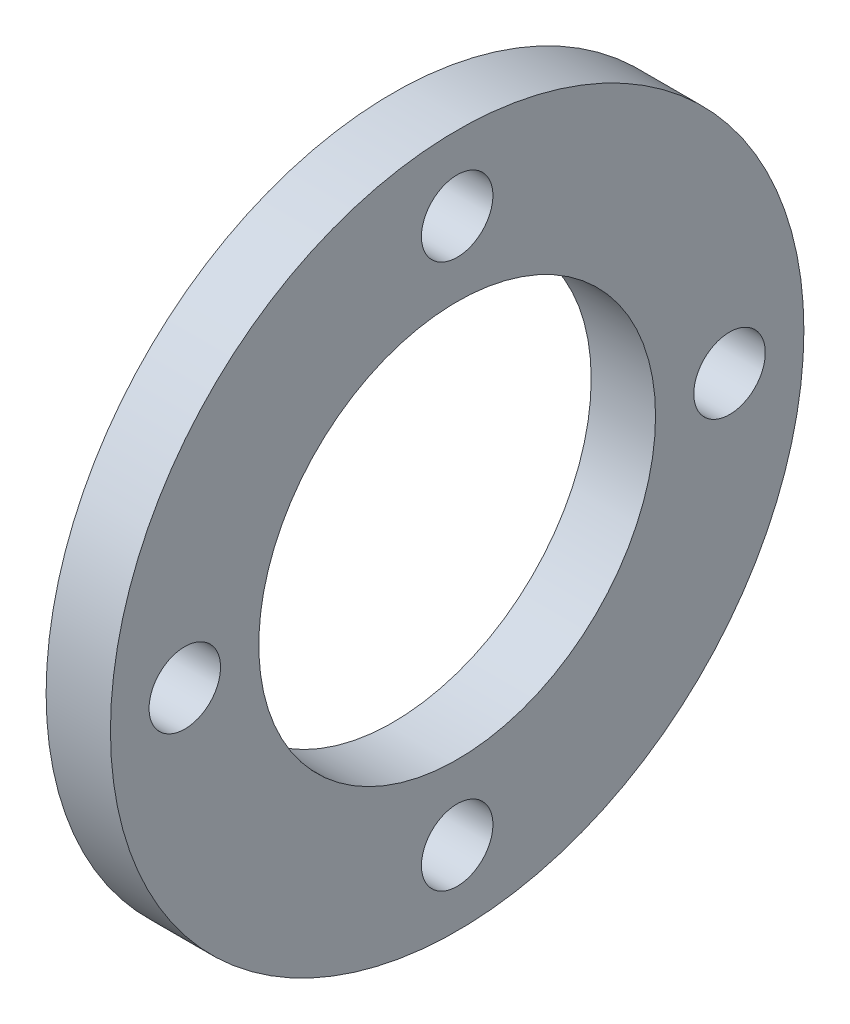
ISO-10303-21;
HEADER;
FILE_DESCRIPTION(('STEP AP214'),'2;1');
FILE_NAME('part.step','',(''),(''),'','','');
FILE_SCHEMA(('AUTOMOTIVE_DESIGN { 1 0 10303 214 1 1 1 1 }'));
ENDSEC;
DATA;
#1=APPLICATION_CONTEXT('core data for automotive mechanical design processes');
#2=APPLICATION_PROTOCOL_DEFINITION('international standard','automotive_design',2000,#1);
#3=PRODUCT_CONTEXT('',#1,'mechanical');
#4=PRODUCT('Part','Part','',(#3));
#5=PRODUCT_RELATED_PRODUCT_CATEGORY('part','',(#4));
#6=PRODUCT_DEFINITION_FORMATION('','',#4);
#7=PRODUCT_DEFINITION_CONTEXT('part definition',#1,'design');
#8=PRODUCT_DEFINITION('design','',#6,#7);
#9=PRODUCT_DEFINITION_SHAPE('','',#8);
#10=(LENGTH_UNIT() NAMED_UNIT(*) SI_UNIT(.MILLI.,.METRE.));
#11=(NAMED_UNIT(*) PLANE_ANGLE_UNIT() SI_UNIT($,.RADIAN.));
#12=(NAMED_UNIT(*) SI_UNIT($,.STERADIAN.) SOLID_ANGLE_UNIT());
#13=UNCERTAINTY_MEASURE_WITH_UNIT(LENGTH_MEASURE(1.E-05),#10,'distance_accuracy_value','');
#14=(GEOMETRIC_REPRESENTATION_CONTEXT(3) GLOBAL_UNCERTAINTY_ASSIGNED_CONTEXT((#13)) GLOBAL_UNIT_ASSIGNED_CONTEXT((#10,
#11,#12)) REPRESENTATION_CONTEXT('',''));
#15=CARTESIAN_POINT('',(0.,0.,0.));
#16=DIRECTION('',(0.,0.,1.));
#17=DIRECTION('',(1.,0.,0.));
#18=AXIS2_PLACEMENT_3D('',#15,#16,#17);
#19=CARTESIAN_POINT('',(18.,0.,76.2));
#20=DIRECTION('',(-1.,0.,0.));
#21=DIRECTION('',(0.,0.,1.));
#22=AXIS2_PLACEMENT_3D('',#19,#20,#21);
#23=CYLINDRICAL_SURFACE('',#22,10.);
#24=CARTESIAN_POINT('',(18.,0.,76.2));
#25=DIRECTION('',(-1.,0.,0.));
#26=DIRECTION('',(0.,0.,1.));
#27=AXIS2_PLACEMENT_3D('',#24,#25,#26);
#28=CIRCLE('',#27,10.);
#29=CARTESIAN_POINT('',(18.,0.,86.2));
#30=VERTEX_POINT('',#29);
#31=EDGE_CURVE('E39',#30,#30,#28,.T.);
#32=ORIENTED_EDGE('',*,*,#31,.F.);
#33=EDGE_LOOP('',(#32));
#34=FACE_BOUND('',#33,.T.);
#35=CARTESIAN_POINT('',(0.,0.,76.2));
#36=DIRECTION('',(-1.,0.,0.));
#37=DIRECTION('',(0.,0.,1.));
#38=AXIS2_PLACEMENT_3D('',#35,#36,#37);
#39=CIRCLE('',#38,10.);
#40=CARTESIAN_POINT('',(0.,0.,86.2));
#41=VERTEX_POINT('',#40);
#42=EDGE_CURVE('E16',#41,#41,#39,.F.);
#43=ORIENTED_EDGE('',*,*,#42,.F.);
#44=EDGE_LOOP('',(#43));
#45=FACE_BOUND('',#44,.T.);
#46=ADVANCED_FACE('F13',(#34,#45),#23,.F.);
#47=CARTESIAN_POINT('',(18.,-76.2,0.));
#48=DIRECTION('',(-1.,0.,0.));
#49=DIRECTION('',(0.,0.,1.));
#50=AXIS2_PLACEMENT_3D('',#47,#48,#49);
#51=CYLINDRICAL_SURFACE('',#50,9.99999999999999);
#52=CARTESIAN_POINT('',(18.,-76.2,0.));
#53=DIRECTION('',(-1.,0.,0.));
#54=DIRECTION('',(0.,0.,1.));
#55=AXIS2_PLACEMENT_3D('',#52,#53,#54);
#56=CIRCLE('',#55,9.99999999999999);
#57=CARTESIAN_POINT('',(18.,-76.2,10.));
#58=VERTEX_POINT('',#57);
#59=EDGE_CURVE('E36',#58,#58,#56,.T.);
#60=ORIENTED_EDGE('',*,*,#59,.F.);
#61=EDGE_LOOP('',(#60));
#62=FACE_BOUND('',#61,.T.);
#63=CARTESIAN_POINT('',(0.,-76.2,0.));
#64=DIRECTION('',(-1.,0.,0.));
#65=DIRECTION('',(0.,0.,1.));
#66=AXIS2_PLACEMENT_3D('',#63,#64,#65);
#67=CIRCLE('',#66,9.99999999999999);
#68=CARTESIAN_POINT('',(0.,-76.2,10.));
#69=VERTEX_POINT('',#68);
#70=EDGE_CURVE('E50',#69,#69,#67,.F.);
#71=ORIENTED_EDGE('',*,*,#70,.F.);
#72=EDGE_LOOP('',(#71));
#73=FACE_BOUND('',#72,.T.);
#74=ADVANCED_FACE('F61',(#62,#73),#51,.F.);
#75=CARTESIAN_POINT('',(18.,0.,-76.2));
#76=DIRECTION('',(-1.,0.,0.));
#77=DIRECTION('',(0.,0.,1.));
#78=AXIS2_PLACEMENT_3D('',#75,#76,#77);
#79=CYLINDRICAL_SURFACE('',#78,10.);
#80=CARTESIAN_POINT('',(18.,0.,-76.2));
#81=DIRECTION('',(-1.,0.,0.));
#82=DIRECTION('',(0.,0.,1.));
#83=AXIS2_PLACEMENT_3D('',#80,#81,#82);
#84=CIRCLE('',#83,10.);
#85=CARTESIAN_POINT('',(18.,0.,-66.2));
#86=VERTEX_POINT('',#85);
#87=EDGE_CURVE('E33',#86,#86,#84,.T.);
#88=ORIENTED_EDGE('',*,*,#87,.F.);
#89=EDGE_LOOP('',(#88));
#90=FACE_BOUND('',#89,.T.);
#91=CARTESIAN_POINT('',(0.,0.,-76.2));
#92=DIRECTION('',(-1.,0.,0.));
#93=DIRECTION('',(0.,0.,1.));
#94=AXIS2_PLACEMENT_3D('',#91,#92,#93);
#95=CIRCLE('',#94,10.);
#96=CARTESIAN_POINT('',(0.,0.,-66.2));
#97=VERTEX_POINT('',#96);
#98=EDGE_CURVE('E48',#97,#97,#95,.F.);
#99=ORIENTED_EDGE('',*,*,#98,.F.);
#100=EDGE_LOOP('',(#99));
#101=FACE_BOUND('',#100,.T.);
#102=ADVANCED_FACE('F67',(#90,#101),#79,.F.);
#103=CARTESIAN_POINT('',(18.,76.2,0.));
#104=DIRECTION('',(-1.,0.,0.));
#105=DIRECTION('',(0.,0.,1.));
#106=AXIS2_PLACEMENT_3D('',#103,#104,#105);
#107=CYLINDRICAL_SURFACE('',#106,9.99999999999999);
#108=CARTESIAN_POINT('',(18.,76.2,0.));
#109=DIRECTION('',(-1.,0.,0.));
#110=DIRECTION('',(0.,0.,1.));
#111=AXIS2_PLACEMENT_3D('',#108,#109,#110);
#112=CIRCLE('',#111,9.99999999999999);
#113=CARTESIAN_POINT('',(18.,76.2,9.99999999999999));
#114=VERTEX_POINT('',#113);
#115=EDGE_CURVE('E30',#114,#114,#112,.T.);
#116=ORIENTED_EDGE('',*,*,#115,.F.);
#117=EDGE_LOOP('',(#116));
#118=FACE_BOUND('',#117,.T.);
#119=CARTESIAN_POINT('',(0.,76.2,0.));
#120=DIRECTION('',(-1.,0.,0.));
#121=DIRECTION('',(0.,0.,1.));
#122=AXIS2_PLACEMENT_3D('',#119,#120,#121);
#123=CIRCLE('',#122,9.99999999999999);
#124=CARTESIAN_POINT('',(0.,76.2,9.99999999999999));
#125=VERTEX_POINT('',#124);
#126=EDGE_CURVE('E45',#125,#125,#123,.F.);
#127=ORIENTED_EDGE('',*,*,#126,.F.);
#128=EDGE_LOOP('',(#127));
#129=FACE_BOUND('',#128,.T.);
#130=ADVANCED_FACE('F87',(#118,#129),#107,.F.);
#131=CARTESIAN_POINT('',(0.,0.,0.));
#132=DIRECTION('',(1.,0.,0.));
#133=DIRECTION('',(0.,0.,-1.));
#134=AXIS2_PLACEMENT_3D('',#131,#132,#133);
#135=CYLINDRICAL_SURFACE('',#134,55.5);
#136=CARTESIAN_POINT('',(0.,0.,0.));
#137=DIRECTION('',(1.,0.,0.));
#138=DIRECTION('',(0.,0.,-1.));
#139=AXIS2_PLACEMENT_3D('',#136,#137,#138);
#140=CIRCLE('',#139,55.5);
#141=CARTESIAN_POINT('',(0.,0.,-55.5));
#142=VERTEX_POINT('',#141);
#143=EDGE_CURVE('E42',#142,#142,#140,.T.);
#144=ORIENTED_EDGE('',*,*,#143,.F.);
#145=EDGE_LOOP('',(#144));
#146=FACE_BOUND('',#145,.T.);
#147=CARTESIAN_POINT('',(18.,0.,0.));
#148=DIRECTION('',(1.,0.,0.));
#149=DIRECTION('',(0.,0.,-1.));
#150=AXIS2_PLACEMENT_3D('',#147,#148,#149);
#151=CIRCLE('',#150,55.5);
#152=CARTESIAN_POINT('',(18.,0.,-55.5));
#153=VERTEX_POINT('',#152);
#154=EDGE_CURVE('E25',#153,#153,#151,.F.);
#155=ORIENTED_EDGE('',*,*,#154,.F.);
#156=EDGE_LOOP('',(#155));
#157=FACE_BOUND('',#156,.T.);
#158=ADVANCED_FACE('F83',(#146,#157),#135,.F.);
#159=CARTESIAN_POINT('',(0.,-98.1640031628222,-97.));
#160=DIRECTION('',(-1.,0.,0.));
#161=DIRECTION('',(0.,0.,1.));
#162=AXIS2_PLACEMENT_3D('',#159,#160,#161);
#163=PLANE('',#162);
#164=ORIENTED_EDGE('',*,*,#143,.T.);
#165=EDGE_LOOP('',(#164));
#166=FACE_BOUND('',#165,.T.);
#167=ORIENTED_EDGE('',*,*,#126,.T.);
#168=EDGE_LOOP('',(#167));
#169=FACE_BOUND('',#168,.T.);
#170=ORIENTED_EDGE('',*,*,#98,.T.);
#171=EDGE_LOOP('',(#170));
#172=FACE_BOUND('',#171,.T.);
#173=ORIENTED_EDGE('',*,*,#70,.T.);
#174=EDGE_LOOP('',(#173));
#175=FACE_BOUND('',#174,.T.);
#176=ORIENTED_EDGE('',*,*,#42,.T.);
#177=EDGE_LOOP('',(#176));
#178=FACE_BOUND('',#177,.T.);
#179=CARTESIAN_POINT('',(0.,0.,0.));
#180=DIRECTION('',(1.,0.,0.));
#181=DIRECTION('',(0.,0.,-1.));
#182=AXIS2_PLACEMENT_3D('',#179,#180,#181);
#183=CIRCLE('',#182,97.);
#184=CARTESIAN_POINT('',(0.,0.,-97.));
#185=VERTEX_POINT('',#184);
#186=EDGE_CURVE('E20',#185,#185,#183,.T.);
#187=ORIENTED_EDGE('',*,*,#186,.F.);
#188=EDGE_LOOP('',(#187));
#189=FACE_BOUND('',#188,.T.);
#190=ADVANCED_FACE('F57',(#166,#169,#172,#175,#178,#189),#163,.T.);
#191=CARTESIAN_POINT('',(18.,-98.1640031628222,97.));
#192=DIRECTION('',(1.,0.,0.));
#193=DIRECTION('',(0.,0.,-1.));
#194=AXIS2_PLACEMENT_3D('',#191,#192,#193);
#195=PLANE('',#194);
#196=ORIENTED_EDGE('',*,*,#154,.T.);
#197=EDGE_LOOP('',(#196));
#198=FACE_BOUND('',#197,.T.);
#199=ORIENTED_EDGE('',*,*,#115,.T.);
#200=EDGE_LOOP('',(#199));
#201=FACE_BOUND('',#200,.T.);
#202=ORIENTED_EDGE('',*,*,#87,.T.);
#203=EDGE_LOOP('',(#202));
#204=FACE_BOUND('',#203,.T.);
#205=ORIENTED_EDGE('',*,*,#59,.T.);
#206=EDGE_LOOP('',(#205));
#207=FACE_BOUND('',#206,.T.);
#208=ORIENTED_EDGE('',*,*,#31,.T.);
#209=EDGE_LOOP('',(#208));
#210=FACE_BOUND('',#209,.T.);
#211=CARTESIAN_POINT('',(18.,0.,0.));
#212=DIRECTION('',(1.,0.,0.));
#213=DIRECTION('',(0.,0.,-1.));
#214=AXIS2_PLACEMENT_3D('',#211,#212,#213);
#215=CIRCLE('',#214,97.);
#216=CARTESIAN_POINT('',(18.,0.,-97.));
#217=VERTEX_POINT('',#216);
#218=EDGE_CURVE('E8',#217,#217,#215,.F.);
#219=ORIENTED_EDGE('',*,*,#218,.F.);
#220=EDGE_LOOP('',(#219));
#221=FACE_BOUND('',#220,.T.);
#222=ADVANCED_FACE('F72',(#198,#201,#204,#207,#210,#221),#195,.T.);
#223=CARTESIAN_POINT('',(18.,0.,0.));
#224=DIRECTION('',(1.,0.,0.));
#225=DIRECTION('',(0.,0.,-1.));
#226=AXIS2_PLACEMENT_3D('',#223,#224,#225);
#227=CYLINDRICAL_SURFACE('',#226,97.);
#228=ORIENTED_EDGE('',*,*,#186,.T.);
#229=EDGE_LOOP('',(#228));
#230=FACE_BOUND('',#229,.T.);
#231=ORIENTED_EDGE('',*,*,#218,.T.);
#232=EDGE_LOOP('',(#231));
#233=FACE_BOUND('',#232,.T.);
#234=ADVANCED_FACE('F70',(#230,#233),#227,.T.);
#235=CLOSED_SHELL('',(#46,#74,#102,#130,#158,#190,#222,#234));
#236=MANIFOLD_SOLID_BREP('B1',#235);
#237=ADVANCED_BREP_SHAPE_REPRESENTATION('',(#18,#236),#14);
#238=SHAPE_DEFINITION_REPRESENTATION(#9,#237);
ENDSEC;
END-ISO-10303-21;
